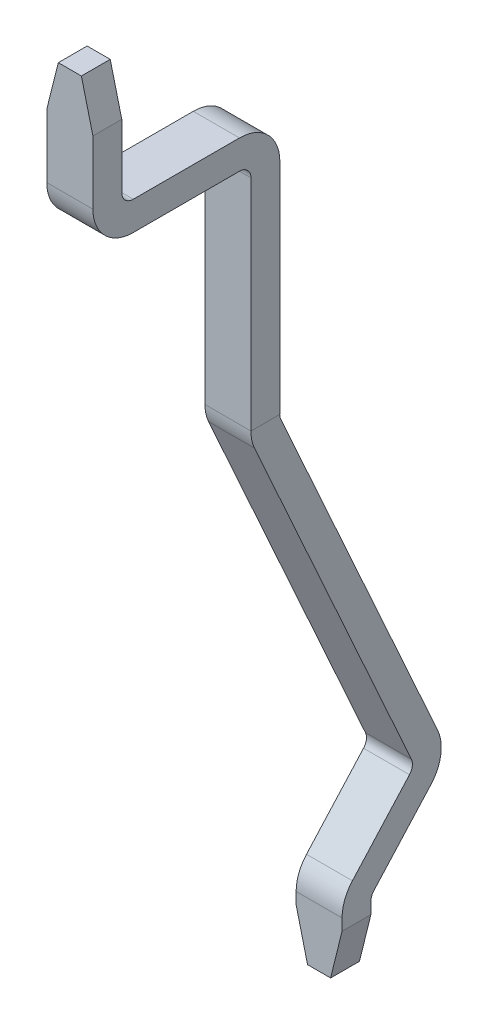
ISO-10303-21;
HEADER;
FILE_DESCRIPTION(('STEP AP214'),'2;1');
FILE_NAME('part.step','',(''),(''),'','','');
FILE_SCHEMA(('AUTOMOTIVE_DESIGN { 1 0 10303 214 1 1 1 1 }'));
ENDSEC;
DATA;
#1=APPLICATION_CONTEXT('core data for automotive mechanical design processes');
#2=APPLICATION_PROTOCOL_DEFINITION('international standard','automotive_design',2000,#1);
#3=PRODUCT_CONTEXT('',#1,'mechanical');
#4=PRODUCT('Part','Part','',(#3));
#5=PRODUCT_RELATED_PRODUCT_CATEGORY('part','',(#4));
#6=PRODUCT_DEFINITION_FORMATION('','',#4);
#7=PRODUCT_DEFINITION_CONTEXT('part definition',#1,'design');
#8=PRODUCT_DEFINITION('design','',#6,#7);
#9=PRODUCT_DEFINITION_SHAPE('','',#8);
#10=(LENGTH_UNIT() NAMED_UNIT(*) SI_UNIT(.MILLI.,.METRE.));
#11=(NAMED_UNIT(*) PLANE_ANGLE_UNIT() SI_UNIT($,.RADIAN.));
#12=(NAMED_UNIT(*) SI_UNIT($,.STERADIAN.) SOLID_ANGLE_UNIT());
#13=UNCERTAINTY_MEASURE_WITH_UNIT(LENGTH_MEASURE(1.E-05),#10,'distance_accuracy_value','');
#14=(GEOMETRIC_REPRESENTATION_CONTEXT(3) GLOBAL_UNCERTAINTY_ASSIGNED_CONTEXT((#13)) GLOBAL_UNIT_ASSIGNED_CONTEXT((#10,
#11,#12)) REPRESENTATION_CONTEXT('',''));
#15=CARTESIAN_POINT('',(0.,0.,0.));
#16=DIRECTION('',(0.,0.,1.));
#17=DIRECTION('',(1.,0.,0.));
#18=AXIS2_PLACEMENT_3D('',#15,#16,#17);
#19=CARTESIAN_POINT('',(0.,2.35,1.37));
#20=DIRECTION('',(0.,-1.,0.));
#21=DIRECTION('',(0.,0.,-1.));
#22=AXIS2_PLACEMENT_3D('',#19,#20,#21);
#23=PLANE('',#22);
#24=DIRECTION('',(0.,0.,1.));
#25=VECTOR('',#24,1.);
#26=CARTESIAN_POINT('',(-0.1,2.35,8.42052393868072));
#27=LINE('',#26,#25);
#28=CARTESIAN_POINT('',(-0.1,2.35,1.245));
#29=VERTEX_POINT('',#28);
#30=CARTESIAN_POINT('',(-0.1,2.35,1.495));
#31=VERTEX_POINT('',#30);
#32=EDGE_CURVE('E263',#29,#31,#27,.T.);
#33=ORIENTED_EDGE('',*,*,#32,.T.);
#34=DIRECTION('',(-1.,0.,0.));
#35=VECTOR('',#34,1.);
#36=CARTESIAN_POINT('',(0.2,2.35,1.495));
#37=LINE('',#36,#35);
#38=CARTESIAN_POINT('',(0.1,2.35,1.495));
#39=VERTEX_POINT('',#38);
#40=EDGE_CURVE('E234',#31,#39,#37,.F.);
#41=ORIENTED_EDGE('',*,*,#40,.T.);
#42=DIRECTION('',(0.,0.,1.));
#43=VECTOR('',#42,1.);
#44=CARTESIAN_POINT('',(0.1,2.35,8.42052883706733));
#45=LINE('',#44,#43);
#46=CARTESIAN_POINT('',(0.1,2.35,1.245));
#47=VERTEX_POINT('',#46);
#48=EDGE_CURVE('E213',#47,#39,#45,.T.);
#49=ORIENTED_EDGE('',*,*,#48,.F.);
#50=DIRECTION('',(1.,0.,0.));
#51=VECTOR('',#50,1.);
#52=CARTESIAN_POINT('',(-0.2,2.35,1.245));
#53=LINE('',#52,#51);
#54=EDGE_CURVE('E250',#47,#29,#53,.F.);
#55=ORIENTED_EDGE('',*,*,#54,.T.);
#56=EDGE_LOOP('',(#33,#41,#49,#55));
#57=FACE_BOUND('',#56,.T.);
#58=ADVANCED_FACE('F16',(#57),#23,.F.);
#59=CARTESIAN_POINT('',(-0.1,2.35,8.42052393868072));
#60=DIRECTION('',(0.970142500145331,-0.242535625036336,0.));
#61=DIRECTION('',(0.242535625036336,0.970142500145331,0.));
#62=AXIS2_PLACEMENT_3D('',#59,#60,#61);
#63=PLANE('',#62);
#64=DIRECTION('',(0.242535625036333,0.970142500145332,0.));
#65=VECTOR('',#64,1.);
#66=CARTESIAN_POINT('',(-0.2,1.95,1.495));
#67=LINE('',#66,#65);
#68=CARTESIAN_POINT('',(-0.2,1.95,1.495));
#69=VERTEX_POINT('',#68);
#70=EDGE_CURVE('E201',#69,#31,#67,.T.);
#71=ORIENTED_EDGE('',*,*,#70,.T.);
#72=ORIENTED_EDGE('',*,*,#32,.F.);
#73=DIRECTION('',(-0.242535625036333,-0.970142500145332,0.));
#74=VECTOR('',#73,1.);
#75=CARTESIAN_POINT('',(-0.1,2.35,1.245));
#76=LINE('',#75,#74);
#77=CARTESIAN_POINT('',(-0.2,1.95,1.245));
#78=VERTEX_POINT('',#77);
#79=EDGE_CURVE('E230',#29,#78,#76,.T.);
#80=ORIENTED_EDGE('',*,*,#79,.T.);
#81=DIRECTION('',(0.,0.,1.));
#82=VECTOR('',#81,1.);
#83=CARTESIAN_POINT('',(-0.2,1.95,1.495));
#84=LINE('',#83,#82);
#85=EDGE_CURVE('E241',#78,#69,#84,.T.);
#86=ORIENTED_EDGE('',*,*,#85,.T.);
#87=EDGE_LOOP('',(#71,#72,#80,#86));
#88=FACE_BOUND('',#87,.T.);
#89=ADVANCED_FACE('F400',(#88),#63,.F.);
#90=CARTESIAN_POINT('',(-0.2,2.35,1.245));
#91=DIRECTION('',(0.,0.,1.));
#92=DIRECTION('',(1.,0.,0.));
#93=AXIS2_PLACEMENT_3D('',#90,#91,#92);
#94=PLANE('',#93);
#95=ORIENTED_EDGE('',*,*,#79,.F.);
#96=ORIENTED_EDGE('',*,*,#54,.F.);
#97=DIRECTION('',(-0.242535625036336,0.970142500145331,0.));
#98=VECTOR('',#97,1.);
#99=CARTESIAN_POINT('',(0.1,2.35,1.245));
#100=LINE('',#99,#98);
#101=CARTESIAN_POINT('',(0.2,1.95,1.245));
#102=VERTEX_POINT('',#101);
#103=EDGE_CURVE('E231',#102,#47,#100,.T.);
#104=ORIENTED_EDGE('',*,*,#103,.F.);
#105=DIRECTION('',(0.,1.,0.));
#106=VECTOR('',#105,1.);
#107=CARTESIAN_POINT('',(0.2,2.35,1.245));
#108=LINE('',#107,#106);
#109=CARTESIAN_POINT('',(0.2,1.4,1.245));
#110=VERTEX_POINT('',#109);
#111=EDGE_CURVE('E220',#102,#110,#108,.F.);
#112=ORIENTED_EDGE('',*,*,#111,.T.);
#113=DIRECTION('',(-1.,0.,0.));
#114=VECTOR('',#113,1.);
#115=CARTESIAN_POINT('',(0.,1.4,1.24499999999999));
#116=LINE('',#115,#114);
#117=CARTESIAN_POINT('',(-0.2,1.4,1.245));
#118=VERTEX_POINT('',#117);
#119=EDGE_CURVE('E228',#110,#118,#116,.T.);
#120=ORIENTED_EDGE('',*,*,#119,.T.);
#121=DIRECTION('',(0.,1.,0.));
#122=VECTOR('',#121,1.);
#123=CARTESIAN_POINT('',(-0.2,2.35,1.245));
#124=LINE('',#123,#122);
#125=EDGE_CURVE('E245',#118,#78,#124,.T.);
#126=ORIENTED_EDGE('',*,*,#125,.T.);
#127=EDGE_LOOP('',(#95,#96,#104,#112,#120,#126));
#128=FACE_BOUND('',#127,.T.);
#129=ADVANCED_FACE('F395',(#128),#94,.F.);
#130=CARTESIAN_POINT('',(0.,1.4,1.145));
#131=DIRECTION('',(-1.,0.,0.));
#132=DIRECTION('',(0.,-1.,0.));
#133=AXIS2_PLACEMENT_3D('',#130,#131,#132);
#134=CYLINDRICAL_SURFACE('',#133,0.0999999999999946);
#135=ORIENTED_EDGE('',*,*,#119,.F.);
#136=CARTESIAN_POINT('',(0.2,1.4,1.145));
#137=DIRECTION('',(-1.,0.,0.));
#138=DIRECTION('',(0.,-1.,0.));
#139=AXIS2_PLACEMENT_3D('',#136,#137,#138);
#140=CIRCLE('',#139,0.0999999999999946);
#141=CARTESIAN_POINT('',(0.2,1.3,1.145));
#142=VERTEX_POINT('',#141);
#143=EDGE_CURVE('E334',#110,#142,#140,.F.);
#144=ORIENTED_EDGE('',*,*,#143,.T.);
#145=DIRECTION('',(1.,0.,0.));
#146=VECTOR('',#145,1.);
#147=CARTESIAN_POINT('',(-0.2,1.3,1.145));
#148=LINE('',#147,#146);
#149=CARTESIAN_POINT('',(-0.2,1.3,1.145));
#150=VERTEX_POINT('',#149);
#151=EDGE_CURVE('E226',#142,#150,#148,.F.);
#152=ORIENTED_EDGE('',*,*,#151,.T.);
#153=CARTESIAN_POINT('',(-0.2,1.4,1.145));
#154=DIRECTION('',(-1.,0.,0.));
#155=DIRECTION('',(0.,-1.,0.));
#156=AXIS2_PLACEMENT_3D('',#153,#154,#155);
#157=CIRCLE('',#156,0.0999999999999946);
#158=EDGE_CURVE('E339',#150,#118,#157,.T.);
#159=ORIENTED_EDGE('',*,*,#158,.T.);
#160=EDGE_LOOP('',(#135,#144,#152,#159));
#161=FACE_BOUND('',#160,.T.);
#162=ADVANCED_FACE('F392',(#161),#134,.F.);
#163=CARTESIAN_POINT('',(-0.2,1.3,1.145));
#164=DIRECTION('',(0.,-1.,0.));
#165=DIRECTION('',(0.,0.,-1.));
#166=AXIS2_PLACEMENT_3D('',#163,#164,#165);
#167=PLANE('',#166);
#168=ORIENTED_EDGE('',*,*,#151,.F.);
#169=DIRECTION('',(0.,0.,1.));
#170=VECTOR('',#169,1.);
#171=CARTESIAN_POINT('',(0.2,1.3,1.245));
#172=LINE('',#171,#170);
#173=CARTESIAN_POINT('',(0.2,1.3,0.225000000000004));
#174=VERTEX_POINT('',#173);
#175=EDGE_CURVE('E333',#142,#174,#172,.F.);
#176=ORIENTED_EDGE('',*,*,#175,.T.);
#177=DIRECTION('',(1.,0.,0.));
#178=VECTOR('',#177,1.);
#179=CARTESIAN_POINT('',(0.,1.3,0.225000000000004));
#180=LINE('',#179,#178);
#181=CARTESIAN_POINT('',(-0.2,1.3,0.225000000000004));
#182=VERTEX_POINT('',#181);
#183=EDGE_CURVE('E177',#182,#174,#180,.T.);
#184=ORIENTED_EDGE('',*,*,#183,.F.);
#185=DIRECTION('',(0.,0.,1.));
#186=VECTOR('',#185,1.);
#187=CARTESIAN_POINT('',(-0.2,1.3,1.495));
#188=LINE('',#187,#186);
#189=EDGE_CURVE('E342',#182,#150,#188,.T.);
#190=ORIENTED_EDGE('',*,*,#189,.T.);
#191=EDGE_LOOP('',(#168,#176,#184,#190));
#192=FACE_BOUND('',#191,.T.);
#193=ADVANCED_FACE('F383',(#192),#167,.F.);
#194=CARTESIAN_POINT('',(0.,0.95,0.225000000000004));
#195=DIRECTION('',(1.,0.,0.));
#196=DIRECTION('',(0.,1.,0.));
#197=AXIS2_PLACEMENT_3D('',#194,#195,#196);
#198=CYLINDRICAL_SURFACE('',#197,0.350000000000005);
#199=CARTESIAN_POINT('',(0.2,0.95,0.225000000000004));
#200=DIRECTION('',(1.,0.,0.));
#201=DIRECTION('',(0.,1.,0.));
#202=AXIS2_PLACEMENT_3D('',#199,#200,#201);
#203=CIRCLE('',#202,0.350000000000005);
#204=CARTESIAN_POINT('',(0.199999999999998,0.95,-0.125));
#205=VERTEX_POINT('',#204);
#206=EDGE_CURVE('E329',#174,#205,#203,.F.);
#207=ORIENTED_EDGE('',*,*,#206,.T.);
#208=DIRECTION('',(1.,0.,0.));
#209=VECTOR('',#208,1.);
#210=CARTESIAN_POINT('',(-0.2,0.95,-0.125));
#211=LINE('',#210,#209);
#212=CARTESIAN_POINT('',(-0.2,0.95,-0.125));
#213=VERTEX_POINT('',#212);
#214=EDGE_CURVE('E217',#205,#213,#211,.F.);
#215=ORIENTED_EDGE('',*,*,#214,.T.);
#216=CARTESIAN_POINT('',(-0.2,0.95,0.225000000000004));
#217=DIRECTION('',(1.,0.,0.));
#218=DIRECTION('',(0.,1.,0.));
#219=AXIS2_PLACEMENT_3D('',#216,#217,#218);
#220=CIRCLE('',#219,0.350000000000005);
#221=EDGE_CURVE('E187',#213,#182,#220,.T.);
#222=ORIENTED_EDGE('',*,*,#221,.T.);
#223=ORIENTED_EDGE('',*,*,#183,.T.);
#224=EDGE_LOOP('',(#207,#215,#222,#223));
#225=FACE_BOUND('',#224,.T.);
#226=ADVANCED_FACE('F388',(#225),#198,.T.);
#227=CARTESIAN_POINT('',(-0.2,0.95,-0.125));
#228=DIRECTION('',(0.,0.,1.));
#229=DIRECTION('',(1.,0.,0.));
#230=AXIS2_PLACEMENT_3D('',#227,#228,#229);
#231=PLANE('',#230);
#232=ORIENTED_EDGE('',*,*,#214,.F.);
#233=DIRECTION('',(0.,1.,0.));
#234=VECTOR('',#233,1.);
#235=CARTESIAN_POINT('',(0.199999999999995,2.35,-0.125000000000001));
#236=LINE('',#235,#234);
#237=CARTESIAN_POINT('',(0.199999999999995,-0.95,-0.125000000000002));
#238=VERTEX_POINT('',#237);
#239=EDGE_CURVE('E332',#205,#238,#236,.F.);
#240=ORIENTED_EDGE('',*,*,#239,.T.);
#241=DIRECTION('',(1.,0.,0.));
#242=VECTOR('',#241,1.);
#243=CARTESIAN_POINT('',(0.19899999999999,-0.950000000000001,-0.125000000000002));
#244=LINE('',#243,#242);
#245=CARTESIAN_POINT('',(0.198999999999995,-0.95,-0.125000000000001));
#246=VERTEX_POINT('',#245);
#247=EDGE_CURVE('E223',#246,#238,#244,.T.);
#248=ORIENTED_EDGE('',*,*,#247,.F.);
#249=DIRECTION('',(1.,0.,0.));
#250=VECTOR('',#249,1.);
#251=CARTESIAN_POINT('',(-0.2,-0.95,-0.125));
#252=LINE('',#251,#250);
#253=CARTESIAN_POINT('',(-0.198999999999995,-0.95,-0.125000000000001));
#254=VERTEX_POINT('',#253);
#255=EDGE_CURVE('E173',#254,#246,#252,.T.);
#256=ORIENTED_EDGE('',*,*,#255,.F.);
#257=DIRECTION('',(1.,0.,0.));
#258=VECTOR('',#257,1.);
#259=CARTESIAN_POINT('',(-0.198999999999996,-0.95,-0.125));
#260=LINE('',#259,#258);
#261=CARTESIAN_POINT('',(-0.2,-0.95,-0.125));
#262=VERTEX_POINT('',#261);
#263=EDGE_CURVE('E19',#262,#254,#260,.T.);
#264=ORIENTED_EDGE('',*,*,#263,.F.);
#265=DIRECTION('',(0.,1.,0.));
#266=VECTOR('',#265,1.);
#267=CARTESIAN_POINT('',(-0.2,2.35,-0.125));
#268=LINE('',#267,#266);
#269=EDGE_CURVE('E171',#262,#213,#268,.T.);
#270=ORIENTED_EDGE('',*,*,#269,.T.);
#271=EDGE_LOOP('',(#232,#240,#248,#256,#264,#270));
#272=FACE_BOUND('',#271,.T.);
#273=ADVANCED_FACE('F170',(#272),#231,.F.);
#274=CARTESIAN_POINT('',(0.2,1.05,1.145));
#275=DIRECTION('',(0.,1.,0.));
#276=DIRECTION('',(0.,0.,1.));
#277=AXIS2_PLACEMENT_3D('',#274,#275,#276);
#278=PLANE('',#277);
#279=DIRECTION('',(-1.,0.,0.));
#280=VECTOR('',#279,1.);
#281=CARTESIAN_POINT('',(0.,1.05,1.145));
#282=LINE('',#281,#280);
#283=CARTESIAN_POINT('',(-0.2,1.05,1.145));
#284=VERTEX_POINT('',#283);
#285=CARTESIAN_POINT('',(0.2,1.05,1.145));
#286=VERTEX_POINT('',#285);
#287=EDGE_CURVE('E202',#284,#286,#282,.F.);
#288=ORIENTED_EDGE('',*,*,#287,.F.);
#289=DIRECTION('',(0.,0.,1.));
#290=VECTOR('',#289,1.);
#291=CARTESIAN_POINT('',(-0.2,1.05,1.495));
#292=LINE('',#291,#290);
#293=CARTESIAN_POINT('',(-0.2,1.05,0.225000000000004));
#294=VERTEX_POINT('',#293);
#295=EDGE_CURVE('E193',#284,#294,#292,.F.);
#296=ORIENTED_EDGE('',*,*,#295,.T.);
#297=DIRECTION('',(1.,0.,0.));
#298=VECTOR('',#297,1.);
#299=CARTESIAN_POINT('',(0.,1.05,0.225000000000004));
#300=LINE('',#299,#298);
#301=CARTESIAN_POINT('',(0.2,1.05,0.225000000000004));
#302=VERTEX_POINT('',#301);
#303=EDGE_CURVE('E218',#294,#302,#300,.T.);
#304=ORIENTED_EDGE('',*,*,#303,.T.);
#305=DIRECTION('',(0.,0.,1.));
#306=VECTOR('',#305,1.);
#307=CARTESIAN_POINT('',(0.2,1.05,1.245));
#308=LINE('',#307,#306);
#309=EDGE_CURVE('E324',#302,#286,#308,.T.);
#310=ORIENTED_EDGE('',*,*,#309,.T.);
#311=EDGE_LOOP('',(#288,#296,#304,#310));
#312=FACE_BOUND('',#311,.T.);
#313=ADVANCED_FACE('F534',(#312),#278,.F.);
#314=CARTESIAN_POINT('',(0.,1.4,1.145));
#315=DIRECTION('',(-1.,0.,0.));
#316=DIRECTION('',(0.,-1.,0.));
#317=AXIS2_PLACEMENT_3D('',#314,#315,#316);
#318=CYLINDRICAL_SURFACE('',#317,0.349999999999995);
#319=CARTESIAN_POINT('',(-0.2,1.4,1.145));
#320=DIRECTION('',(-1.,0.,0.));
#321=DIRECTION('',(0.,-1.,0.));
#322=AXIS2_PLACEMENT_3D('',#319,#320,#321);
#323=CIRCLE('',#322,0.349999999999995);
#324=CARTESIAN_POINT('',(-0.2,1.4,1.495));
#325=VERTEX_POINT('',#324);
#326=EDGE_CURVE('E195',#325,#284,#323,.F.);
#327=ORIENTED_EDGE('',*,*,#326,.T.);
#328=ORIENTED_EDGE('',*,*,#287,.T.);
#329=CARTESIAN_POINT('',(0.2,1.4,1.145));
#330=DIRECTION('',(-1.,0.,0.));
#331=DIRECTION('',(0.,-1.,0.));
#332=AXIS2_PLACEMENT_3D('',#329,#330,#331);
#333=CIRCLE('',#332,0.349999999999995);
#334=CARTESIAN_POINT('',(0.2,1.4,1.495));
#335=VERTEX_POINT('',#334);
#336=EDGE_CURVE('E321',#286,#335,#333,.T.);
#337=ORIENTED_EDGE('',*,*,#336,.T.);
#338=DIRECTION('',(-1.,0.,0.));
#339=VECTOR('',#338,1.);
#340=CARTESIAN_POINT('',(0.2,1.4,1.495));
#341=LINE('',#340,#339);
#342=EDGE_CURVE('E198',#335,#325,#341,.T.);
#343=ORIENTED_EDGE('',*,*,#342,.T.);
#344=EDGE_LOOP('',(#327,#328,#337,#343));
#345=FACE_BOUND('',#344,.T.);
#346=ADVANCED_FACE('F531',(#345),#318,.T.);
#347=CARTESIAN_POINT('',(0.2,2.35,1.495));
#348=DIRECTION('',(0.,0.,-1.));
#349=DIRECTION('',(-1.,0.,0.));
#350=AXIS2_PLACEMENT_3D('',#347,#348,#349);
#351=PLANE('',#350);
#352=ORIENTED_EDGE('',*,*,#70,.F.);
#353=DIRECTION('',(0.,1.,0.));
#354=VECTOR('',#353,1.);
#355=CARTESIAN_POINT('',(-0.2,2.35,1.495));
#356=LINE('',#355,#354);
#357=EDGE_CURVE('E244',#69,#325,#356,.F.);
#358=ORIENTED_EDGE('',*,*,#357,.T.);
#359=ORIENTED_EDGE('',*,*,#342,.F.);
#360=DIRECTION('',(0.,1.,0.));
#361=VECTOR('',#360,1.);
#362=CARTESIAN_POINT('',(0.200000000000001,2.35,1.495));
#363=LINE('',#362,#361);
#364=CARTESIAN_POINT('',(0.200000000000001,1.95,1.495));
#365=VERTEX_POINT('',#364);
#366=EDGE_CURVE('E207',#335,#365,#363,.T.);
#367=ORIENTED_EDGE('',*,*,#366,.T.);
#368=DIRECTION('',(-0.242535625036336,0.970142500145331,0.));
#369=VECTOR('',#368,1.);
#370=CARTESIAN_POINT('',(0.1,2.35,1.495));
#371=LINE('',#370,#369);
#372=EDGE_CURVE('E210',#39,#365,#371,.F.);
#373=ORIENTED_EDGE('',*,*,#372,.F.);
#374=ORIENTED_EDGE('',*,*,#40,.F.);
#375=EDGE_LOOP('',(#352,#358,#359,#367,#373,#374));
#376=FACE_BOUND('',#375,.T.);
#377=ADVANCED_FACE('F527',(#376),#351,.F.);
#378=CARTESIAN_POINT('',(0.1,2.35,8.42052883706733));
#379=DIRECTION('',(0.970142500145331,0.242535625036336,0.));
#380=DIRECTION('',(-0.242535625036336,0.970142500145331,0.));
#381=AXIS2_PLACEMENT_3D('',#378,#379,#380);
#382=PLANE('',#381);
#383=ORIENTED_EDGE('',*,*,#372,.T.);
#384=DIRECTION('',(0.,0.,1.));
#385=VECTOR('',#384,1.);
#386=CARTESIAN_POINT('',(0.2,1.95,1.245));
#387=LINE('',#386,#385);
#388=EDGE_CURVE('E203',#365,#102,#387,.F.);
#389=ORIENTED_EDGE('',*,*,#388,.T.);
#390=ORIENTED_EDGE('',*,*,#103,.T.);
#391=ORIENTED_EDGE('',*,*,#48,.T.);
#392=EDGE_LOOP('',(#383,#389,#390,#391));
#393=FACE_BOUND('',#392,.T.);
#394=ADVANCED_FACE('F524',(#393),#382,.T.);
#395=CARTESIAN_POINT('',(-0.2,2.35,1.495));
#396=DIRECTION('',(1.,0.,0.));
#397=DIRECTION('',(0.,1.,0.));
#398=AXIS2_PLACEMENT_3D('',#395,#396,#397);
#399=PLANE('',#398);
#400=ORIENTED_EDGE('',*,*,#85,.F.);
#401=ORIENTED_EDGE('',*,*,#125,.F.);
#402=ORIENTED_EDGE('',*,*,#158,.F.);
#403=ORIENTED_EDGE('',*,*,#189,.F.);
#404=ORIENTED_EDGE('',*,*,#221,.F.);
#405=ORIENTED_EDGE('',*,*,#269,.F.);
#406=DIRECTION('',(0.,0.,1.));
#407=VECTOR('',#406,1.);
#408=CARTESIAN_POINT('',(-0.2,-0.95,1.495));
#409=LINE('',#408,#407);
#410=CARTESIAN_POINT('',(-0.199999999999998,-0.95,0.125));
#411=VERTEX_POINT('',#410);
#412=EDGE_CURVE('E183',#411,#262,#409,.F.);
#413=ORIENTED_EDGE('',*,*,#412,.F.);
#414=DIRECTION('',(0.,1.,0.));
#415=VECTOR('',#414,1.);
#416=CARTESIAN_POINT('',(-0.199999999999996,0.95,0.125));
#417=LINE('',#416,#415);
#418=CARTESIAN_POINT('',(-0.199999999999998,0.95,0.125));
#419=VERTEX_POINT('',#418);
#420=EDGE_CURVE('E206',#411,#419,#417,.T.);
#421=ORIENTED_EDGE('',*,*,#420,.T.);
#422=CARTESIAN_POINT('',(-0.2,0.95,0.225000000000004));
#423=DIRECTION('',(1.,0.,0.));
#424=DIRECTION('',(0.,1.,0.));
#425=AXIS2_PLACEMENT_3D('',#422,#423,#424);
#426=CIRCLE('',#425,0.100000000000005);
#427=EDGE_CURVE('E221',#419,#294,#426,.T.);
#428=ORIENTED_EDGE('',*,*,#427,.T.);
#429=ORIENTED_EDGE('',*,*,#295,.F.);
#430=ORIENTED_EDGE('',*,*,#326,.F.);
#431=ORIENTED_EDGE('',*,*,#357,.F.);
#432=EDGE_LOOP('',(#400,#401,#402,#403,#404,#405,#413,#421,#428,#429,#430,#431));
#433=FACE_BOUND('',#432,.T.);
#434=ADVANCED_FACE('F181',(#433),#399,.F.);
#435=CARTESIAN_POINT('',(0.,0.95,0.225000000000004));
#436=DIRECTION('',(1.,0.,0.));
#437=DIRECTION('',(0.,1.,0.));
#438=AXIS2_PLACEMENT_3D('',#435,#436,#437);
#439=CYLINDRICAL_SURFACE('',#438,0.100000000000005);
#440=ORIENTED_EDGE('',*,*,#303,.F.);
#441=ORIENTED_EDGE('',*,*,#427,.F.);
#442=DIRECTION('',(-1.,0.,0.));
#443=VECTOR('',#442,1.);
#444=CARTESIAN_POINT('',(0.2,0.95,0.125));
#445=LINE('',#444,#443);
#446=CARTESIAN_POINT('',(0.2,0.95,0.125));
#447=VERTEX_POINT('',#446);
#448=EDGE_CURVE('E370',#419,#447,#445,.F.);
#449=ORIENTED_EDGE('',*,*,#448,.T.);
#450=CARTESIAN_POINT('',(0.2,0.95,0.225000000000004));
#451=DIRECTION('',(1.,0.,0.));
#452=DIRECTION('',(0.,1.,0.));
#453=AXIS2_PLACEMENT_3D('',#450,#451,#452);
#454=CIRCLE('',#453,0.100000000000005);
#455=EDGE_CURVE('E325',#447,#302,#454,.T.);
#456=ORIENTED_EDGE('',*,*,#455,.T.);
#457=EDGE_LOOP('',(#440,#441,#449,#456));
#458=FACE_BOUND('',#457,.T.);
#459=ADVANCED_FACE('F518',(#458),#439,.F.);
#460=CARTESIAN_POINT('',(0.2,2.35,1.245));
#461=DIRECTION('',(-1.,0.,0.));
#462=DIRECTION('',(0.,0.,1.));
#463=AXIS2_PLACEMENT_3D('',#460,#461,#462);
#464=PLANE('',#463);
#465=ORIENTED_EDGE('',*,*,#366,.F.);
#466=ORIENTED_EDGE('',*,*,#336,.F.);
#467=ORIENTED_EDGE('',*,*,#309,.F.);
#468=ORIENTED_EDGE('',*,*,#455,.F.);
#469=DIRECTION('',(0.,1.,0.));
#470=VECTOR('',#469,1.);
#471=CARTESIAN_POINT('',(0.2,0.95,0.125));
#472=LINE('',#471,#470);
#473=CARTESIAN_POINT('',(0.199999999999998,-0.95,0.125));
#474=VERTEX_POINT('',#473);
#475=EDGE_CURVE('E358',#447,#474,#472,.F.);
#476=ORIENTED_EDGE('',*,*,#475,.T.);
#477=DIRECTION('',(0.,0.,1.));
#478=VECTOR('',#477,1.);
#479=CARTESIAN_POINT('',(0.2,-0.95,1.245));
#480=LINE('',#479,#478);
#481=EDGE_CURVE('E328',#238,#474,#480,.T.);
#482=ORIENTED_EDGE('',*,*,#481,.F.);
#483=ORIENTED_EDGE('',*,*,#239,.F.);
#484=ORIENTED_EDGE('',*,*,#206,.F.);
#485=ORIENTED_EDGE('',*,*,#175,.F.);
#486=ORIENTED_EDGE('',*,*,#143,.F.);
#487=ORIENTED_EDGE('',*,*,#111,.F.);
#488=ORIENTED_EDGE('',*,*,#388,.F.);
#489=EDGE_LOOP('',(#465,#466,#467,#468,#476,#482,#483,#484,#485,#486,#487,#488));
#490=FACE_BOUND('',#489,.T.);
#491=ADVANCED_FACE('F355',(#490),#464,.F.);
#492=CARTESIAN_POINT('',(0.2,0.95,0.125));
#493=DIRECTION('',(0.,0.,-1.));
#494=DIRECTION('',(-1.,0.,0.));
#495=AXIS2_PLACEMENT_3D('',#492,#493,#494);
#496=PLANE('',#495);
#497=ORIENTED_EDGE('',*,*,#448,.F.);
#498=ORIENTED_EDGE('',*,*,#420,.F.);
#499=DIRECTION('',(-1.,0.,0.));
#500=VECTOR('',#499,1.);
#501=CARTESIAN_POINT('',(0.2,-0.95,0.125));
#502=LINE('',#501,#500);
#503=CARTESIAN_POINT('',(-0.198999999999993,-0.95,0.124999999999999));
#504=VERTEX_POINT('',#503);
#505=EDGE_CURVE('E192',#411,#504,#502,.F.);
#506=ORIENTED_EDGE('',*,*,#505,.T.);
#507=DIRECTION('',(-1.,0.,0.));
#508=VECTOR('',#507,1.);
#509=CARTESIAN_POINT('',(0.,-0.95,0.124999999999998));
#510=LINE('',#509,#508);
#511=CARTESIAN_POINT('',(0.198999999999997,-0.95,0.124999999999999));
#512=VERTEX_POINT('',#511);
#513=EDGE_CURVE('E315',#512,#504,#510,.T.);
#514=ORIENTED_EDGE('',*,*,#513,.F.);
#515=DIRECTION('',(-1.,0.,0.));
#516=VECTOR('',#515,1.);
#517=CARTESIAN_POINT('',(0.2,-0.95,0.125));
#518=LINE('',#517,#516);
#519=EDGE_CURVE('E316',#512,#474,#518,.F.);
#520=ORIENTED_EDGE('',*,*,#519,.T.);
#521=ORIENTED_EDGE('',*,*,#475,.F.);
#522=EDGE_LOOP('',(#497,#498,#506,#514,#520,#521));
#523=FACE_BOUND('',#522,.T.);
#524=ADVANCED_FACE('F511',(#523),#496,.F.);
#525=CARTESIAN_POINT('',(0.,-5.5,-0.79));
#526=DIRECTION('',(0.,-1.,0.));
#527=DIRECTION('',(0.,0.,-1.));
#528=AXIS2_PLACEMENT_3D('',#525,#526,#527);
#529=PLANE('',#528);
#530=DIRECTION('',(1.,0.,0.));
#531=VECTOR('',#530,1.);
#532=CARTESIAN_POINT('',(0.2,-5.5,-0.665));
#533=LINE('',#532,#531);
#534=CARTESIAN_POINT('',(0.1,-5.5,-0.665));
#535=VERTEX_POINT('',#534);
#536=CARTESIAN_POINT('',(-0.1,-5.5,-0.665));
#537=VERTEX_POINT('',#536);
#538=EDGE_CURVE('E637',#535,#537,#533,.F.);
#539=ORIENTED_EDGE('',*,*,#538,.T.);
#540=DIRECTION('',(0.,0.,1.));
#541=VECTOR('',#540,1.);
#542=CARTESIAN_POINT('',(-0.1,-5.5,-8.42052393868072));
#543=LINE('',#542,#541);
#544=CARTESIAN_POINT('',(-0.1,-5.5,-0.915));
#545=VERTEX_POINT('',#544);
#546=EDGE_CURVE('E319',#537,#545,#543,.F.);
#547=ORIENTED_EDGE('',*,*,#546,.T.);
#548=DIRECTION('',(1.,0.,0.));
#549=VECTOR('',#548,1.);
#550=CARTESIAN_POINT('',(-0.2,-5.5,-0.915));
#551=LINE('',#550,#549);
#552=CARTESIAN_POINT('',(0.1,-5.5,-0.915));
#553=VERTEX_POINT('',#552);
#554=EDGE_CURVE('E594',#545,#553,#551,.T.);
#555=ORIENTED_EDGE('',*,*,#554,.T.);
#556=DIRECTION('',(0.,0.,1.));
#557=VECTOR('',#556,1.);
#558=CARTESIAN_POINT('',(0.1,-5.5,-8.42052393868072));
#559=LINE('',#558,#557);
#560=EDGE_CURVE('E320',#535,#553,#559,.F.);
#561=ORIENTED_EDGE('',*,*,#560,.F.);
#562=EDGE_LOOP('',(#539,#547,#555,#561));
#563=FACE_BOUND('',#562,.T.);
#564=ADVANCED_FACE('F507',(#563),#529,.T.);
#565=CARTESIAN_POINT('',(0.1,-5.5,-8.42052393868072));
#566=DIRECTION('',(0.970710817842158,-0.240250927415917,0.));
#567=DIRECTION('',(0.240250927415917,0.970710817842158,0.));
#568=AXIS2_PLACEMENT_3D('',#565,#566,#567);
#569=PLANE('',#568);
#570=DIRECTION('',(-0.240250927415917,-0.970710817842158,0.));
#571=VECTOR('',#570,1.);
#572=CARTESIAN_POINT('',(0.198999999999993,-5.1,-0.665));
#573=LINE('',#572,#571);
#574=CARTESIAN_POINT('',(0.198999999999993,-5.1,-0.665));
#575=VERTEX_POINT('',#574);
#576=EDGE_CURVE('E633',#575,#535,#573,.T.);
#577=ORIENTED_EDGE('',*,*,#576,.T.);
#578=ORIENTED_EDGE('',*,*,#560,.T.);
#579=DIRECTION('',(0.240250927415917,0.970710817842158,0.));
#580=VECTOR('',#579,1.);
#581=CARTESIAN_POINT('',(0.1,-5.5,-0.915));
#582=LINE('',#581,#580);
#583=CARTESIAN_POINT('',(0.198999999999993,-5.1,-0.915));
#584=VERTEX_POINT('',#583);
#585=EDGE_CURVE('E590',#553,#584,#582,.T.);
#586=ORIENTED_EDGE('',*,*,#585,.T.);
#587=DIRECTION('',(0.,0.,-1.));
#588=VECTOR('',#587,1.);
#589=CARTESIAN_POINT('',(0.198999999999996,-5.1,0.125));
#590=LINE('',#589,#588);
#591=EDGE_CURVE('E580',#575,#584,#590,.T.);
#592=ORIENTED_EDGE('',*,*,#591,.F.);
#593=EDGE_LOOP('',(#577,#578,#586,#592));
#594=FACE_BOUND('',#593,.T.);
#595=ADVANCED_FACE('F504',(#594),#569,.T.);
#596=CARTESIAN_POINT('',(0.19899999999999,-0.95,-1.525));
#597=DIRECTION('',(0.,1.,0.));
#598=DIRECTION('',(0.,0.,1.));
#599=AXIS2_PLACEMENT_3D('',#596,#597,#598);
#600=PLANE('',#599);
#601=ORIENTED_EDGE('',*,*,#519,.F.);
#602=DIRECTION('',(0.,0.,-1.));
#603=VECTOR('',#602,1.);
#604=CARTESIAN_POINT('',(0.198999999999996,-0.95,0.125));
#605=LINE('',#604,#603);
#606=EDGE_CURVE('E305',#246,#512,#605,.F.);
#607=ORIENTED_EDGE('',*,*,#606,.F.);
#608=ORIENTED_EDGE('',*,*,#247,.T.);
#609=ORIENTED_EDGE('',*,*,#481,.T.);
#610=EDGE_LOOP('',(#601,#607,#608,#609));
#611=FACE_BOUND('',#610,.T.);
#612=ADVANCED_FACE('F348',(#611),#600,.F.);
#613=CARTESIAN_POINT('',(-0.1,-5.5,-8.42052393868072));
#614=DIRECTION('',(0.970710817842158,0.240250927415917,0.));
#615=DIRECTION('',(-0.240250927415917,0.970710817842158,0.));
#616=AXIS2_PLACEMENT_3D('',#613,#614,#615);
#617=PLANE('',#616);
#618=DIRECTION('',(-0.240250927415917,0.970710817842158,0.));
#619=VECTOR('',#618,1.);
#620=CARTESIAN_POINT('',(-0.1,-5.5,-0.665));
#621=LINE('',#620,#619);
#622=CARTESIAN_POINT('',(-0.198999999999993,-5.1,-0.665));
#623=VERTEX_POINT('',#622);
#624=EDGE_CURVE('E634',#537,#623,#621,.T.);
#625=ORIENTED_EDGE('',*,*,#624,.T.);
#626=DIRECTION('',(0.,0.,1.));
#627=VECTOR('',#626,1.);
#628=CARTESIAN_POINT('',(-0.198999999999996,-5.1,0.125));
#629=LINE('',#628,#627);
#630=CARTESIAN_POINT('',(-0.198999999999993,-5.1,-0.915));
#631=VERTEX_POINT('',#630);
#632=EDGE_CURVE('E293',#631,#623,#629,.T.);
#633=ORIENTED_EDGE('',*,*,#632,.F.);
#634=DIRECTION('',(0.240250927415917,-0.970710817842158,0.));
#635=VECTOR('',#634,1.);
#636=CARTESIAN_POINT('',(-0.198999999999993,-5.1,-0.915));
#637=LINE('',#636,#635);
#638=EDGE_CURVE('E608',#631,#545,#637,.T.);
#639=ORIENTED_EDGE('',*,*,#638,.T.);
#640=ORIENTED_EDGE('',*,*,#546,.F.);
#641=EDGE_LOOP('',(#625,#633,#639,#640));
#642=FACE_BOUND('',#641,.T.);
#643=ADVANCED_FACE('F497',(#642),#617,.F.);
#644=CARTESIAN_POINT('',(0.2,-5.,-0.665));
#645=DIRECTION('',(0.,0.,-1.));
#646=DIRECTION('',(0.,1.,0.));
#647=AXIS2_PLACEMENT_3D('',#644,#645,#646);
#648=PLANE('',#647);
#649=DIRECTION('',(0.,1.,0.));
#650=VECTOR('',#649,1.);
#651=CARTESIAN_POINT('',(0.198999999999993,-5.5,-0.665));
#652=LINE('',#651,#650);
#653=CARTESIAN_POINT('',(0.198999999999993,-5.,-0.665000000000002));
#654=VERTEX_POINT('',#653);
#655=EDGE_CURVE('E586',#654,#575,#652,.F.);
#656=ORIENTED_EDGE('',*,*,#655,.F.);
#657=DIRECTION('',(-1.,0.,0.));
#658=VECTOR('',#657,1.);
#659=CARTESIAN_POINT('',(0.,-5.,-0.665000000000005));
#660=LINE('',#659,#658);
#661=CARTESIAN_POINT('',(-0.198999999999993,-5.,-0.665000000000002));
#662=VERTEX_POINT('',#661);
#663=EDGE_CURVE('E631',#662,#654,#660,.F.);
#664=ORIENTED_EDGE('',*,*,#663,.F.);
#665=DIRECTION('',(0.,1.,0.));
#666=VECTOR('',#665,1.);
#667=CARTESIAN_POINT('',(-0.198999999999993,-5.5,-0.665));
#668=LINE('',#667,#666);
#669=EDGE_CURVE('E289',#623,#662,#668,.T.);
#670=ORIENTED_EDGE('',*,*,#669,.F.);
#671=ORIENTED_EDGE('',*,*,#624,.F.);
#672=ORIENTED_EDGE('',*,*,#538,.F.);
#673=ORIENTED_EDGE('',*,*,#576,.F.);
#674=EDGE_LOOP('',(#656,#664,#670,#671,#672,#673));
#675=FACE_BOUND('',#674,.T.);
#676=ADVANCED_FACE('F493',(#675),#648,.F.);
#677=CARTESIAN_POINT('',(0.,-5.,-1.015));
#678=DIRECTION('',(-1.,0.,0.));
#679=DIRECTION('',(0.,-1.,0.));
#680=AXIS2_PLACEMENT_3D('',#677,#678,#679);
#681=CYLINDRICAL_SURFACE('',#680,0.349999999999995);
#682=CARTESIAN_POINT('',(0.198999999999993,-5.,-1.015));
#683=DIRECTION('',(-1.,0.,0.));
#684=DIRECTION('',(0.,-1.,0.));
#685=AXIS2_PLACEMENT_3D('',#682,#683,#684);
#686=CIRCLE('',#685,0.349999999999995);
#687=CARTESIAN_POINT('',(0.198999999999993,-4.76575423726739,-0.754944385482999));
#688=VERTEX_POINT('',#687);
#689=EDGE_CURVE('E294',#688,#654,#686,.F.);
#690=ORIENTED_EDGE('',*,*,#689,.F.);
#691=DIRECTION('',(1.,0.,0.));
#692=VECTOR('',#691,1.);
#693=CARTESIAN_POINT('',(0.2,-4.76575423726739,-0.754944385483));
#694=LINE('',#693,#692);
#695=CARTESIAN_POINT('',(-0.198999999999993,-4.76575423726739,-0.754944385482999));
#696=VERTEX_POINT('',#695);
#697=EDGE_CURVE('E628',#688,#696,#694,.F.);
#698=ORIENTED_EDGE('',*,*,#697,.T.);
#699=CARTESIAN_POINT('',(-0.198999999999993,-5.,-1.015));
#700=DIRECTION('',(-1.,0.,0.));
#701=DIRECTION('',(0.,-1.,0.));
#702=AXIS2_PLACEMENT_3D('',#699,#700,#701);
#703=CIRCLE('',#702,0.349999999999995);
#704=EDGE_CURVE('E287',#662,#696,#703,.T.);
#705=ORIENTED_EDGE('',*,*,#704,.F.);
#706=ORIENTED_EDGE('',*,*,#663,.T.);
#707=EDGE_LOOP('',(#690,#698,#705,#706));
#708=FACE_BOUND('',#707,.T.);
#709=ADVANCED_FACE('F489',(#708),#681,.T.);
#710=CARTESIAN_POINT('',(0.2,-4.21692736078075,-1.24930160414772));
#711=DIRECTION('',(0.,-0.669273607807463,-0.743016041477155));
#712=DIRECTION('',(0.,0.743016041477155,-0.669273607807463));
#713=AXIS2_PLACEMENT_3D('',#710,#711,#712);
#714=PLANE('',#713);
#715=ORIENTED_EDGE('',*,*,#697,.F.);
#716=DIRECTION('',(0.,-0.743016041477151,0.669273607807469));
#717=VECTOR('',#716,1.);
#718=CARTESIAN_POINT('',(0.198999999999991,-4.21692736078075,-1.24930160414772));
#719=LINE('',#718,#717);
#720=CARTESIAN_POINT('',(0.198999999999991,-4.21692736078075,-1.24930160414772));
#721=VERTEX_POINT('',#720);
#722=EDGE_CURVE('E297',#721,#688,#719,.T.);
#723=ORIENTED_EDGE('',*,*,#722,.F.);
#724=DIRECTION('',(1.,0.,0.));
#725=VECTOR('',#724,1.);
#726=CARTESIAN_POINT('',(0.,-4.21692736078075,-1.24930160414772));
#727=LINE('',#726,#725);
#728=CARTESIAN_POINT('',(-0.198999999999991,-4.21692736078075,-1.24930160414772));
#729=VERTEX_POINT('',#728);
#730=EDGE_CURVE('E625',#721,#729,#727,.F.);
#731=ORIENTED_EDGE('',*,*,#730,.T.);
#732=DIRECTION('',(0.,0.743016041477151,-0.669273607807469));
#733=VECTOR('',#732,1.);
#734=CARTESIAN_POINT('',(-0.198999999999993,-4.76575423726739,-0.754944385482996));
#735=LINE('',#734,#733);
#736=EDGE_CURVE('E286',#696,#729,#735,.T.);
#737=ORIENTED_EDGE('',*,*,#736,.F.);
#738=EDGE_LOOP('',(#715,#723,#731,#737));
#739=FACE_BOUND('',#738,.T.);
#740=ADVANCED_FACE('F485',(#739),#714,.F.);
#741=CARTESIAN_POINT('',(0.,-4.15,-1.175));
#742=DIRECTION('',(1.,0.,0.));
#743=DIRECTION('',(0.,1.,0.));
#744=AXIS2_PLACEMENT_3D('',#741,#742,#743);
#745=CYLINDRICAL_SURFACE('',#744,0.100000000000005);
#746=ORIENTED_EDGE('',*,*,#730,.F.);
#747=CARTESIAN_POINT('',(0.19899999999999,-4.15,-1.175));
#748=DIRECTION('',(1.,0.,0.));
#749=DIRECTION('',(0.,1.,0.));
#750=AXIS2_PLACEMENT_3D('',#747,#748,#749);
#751=CIRCLE('',#750,0.100000000000005);
#752=CARTESIAN_POINT('',(0.19899999999999,-4.10887647540836,-1.26615292494024));
#753=VERTEX_POINT('',#752);
#754=EDGE_CURVE('E298',#753,#721,#751,.F.);
#755=ORIENTED_EDGE('',*,*,#754,.F.);
#756=DIRECTION('',(1.,0.,0.));
#757=VECTOR('',#756,1.);
#758=CARTESIAN_POINT('',(0.2,-4.10887647540836,-1.26615292494024));
#759=LINE('',#758,#757);
#760=CARTESIAN_POINT('',(-0.198999999999991,-4.10887647540836,-1.26615292494024));
#761=VERTEX_POINT('',#760);
#762=EDGE_CURVE('E622',#753,#761,#759,.F.);
#763=ORIENTED_EDGE('',*,*,#762,.T.);
#764=CARTESIAN_POINT('',(-0.198999999999991,-4.15,-1.175));
#765=DIRECTION('',(1.,0.,0.));
#766=DIRECTION('',(0.,1.,0.));
#767=AXIS2_PLACEMENT_3D('',#764,#765,#766);
#768=CIRCLE('',#767,0.100000000000005);
#769=EDGE_CURVE('E284',#729,#761,#768,.T.);
#770=ORIENTED_EDGE('',*,*,#769,.F.);
#771=EDGE_LOOP('',(#746,#755,#763,#770));
#772=FACE_BOUND('',#771,.T.);
#773=ADVANCED_FACE('F481',(#772),#745,.F.);
#774=CARTESIAN_POINT('',(0.2,-1.09393233607072,0.0940352372908434));
#775=DIRECTION('',(0.,0.411235245916341,-0.911529249402413));
#776=DIRECTION('',(0.,0.911529249402413,0.411235245916341));
#777=AXIS2_PLACEMENT_3D('',#774,#775,#776);
#778=PLANE('',#777);
#779=ORIENTED_EDGE('',*,*,#762,.F.);
#780=DIRECTION('',(0.,-0.911529249402413,-0.411235245916341));
#781=VECTOR('',#780,1.);
#782=CARTESIAN_POINT('',(0.198999999999996,-1.09393233607072,0.0940352372908435));
#783=LINE('',#782,#781);
#784=CARTESIAN_POINT('',(0.198999999999996,-1.09393233607072,0.0940352372908433));
#785=VERTEX_POINT('',#784);
#786=EDGE_CURVE('E301',#785,#753,#783,.T.);
#787=ORIENTED_EDGE('',*,*,#786,.F.);
#788=DIRECTION('',(-1.,0.,0.));
#789=VECTOR('',#788,1.);
#790=CARTESIAN_POINT('',(0.,-1.09393233607072,0.0940352372908421));
#791=LINE('',#790,#789);
#792=CARTESIAN_POINT('',(-0.198999999999993,-1.09393233607072,0.0940352372908435));
#793=VERTEX_POINT('',#792);
#794=EDGE_CURVE('E620',#793,#785,#791,.F.);
#795=ORIENTED_EDGE('',*,*,#794,.F.);
#796=DIRECTION('',(0.,0.911529249402413,0.411235245916341));
#797=VECTOR('',#796,1.);
#798=CARTESIAN_POINT('',(-0.198999999999991,-4.10887647540836,-1.26615292494024));
#799=LINE('',#798,#797);
#800=EDGE_CURVE('E283',#761,#793,#799,.T.);
#801=ORIENTED_EDGE('',*,*,#800,.F.);
#802=EDGE_LOOP('',(#779,#787,#795,#801));
#803=FACE_BOUND('',#802,.T.);
#804=ADVANCED_FACE('F477',(#803),#778,.F.);
#805=CARTESIAN_POINT('',(0.,-0.95,-0.224999999999997));
#806=DIRECTION('',(-1.,0.,0.));
#807=DIRECTION('',(0.,-1.,0.));
#808=AXIS2_PLACEMENT_3D('',#805,#806,#807);
#809=CYLINDRICAL_SURFACE('',#808,0.349999999999995);
#810=CARTESIAN_POINT('',(0.198999999999996,-0.95,-0.224999999999997));
#811=DIRECTION('',(-1.,0.,0.));
#812=DIRECTION('',(0.,-1.,0.));
#813=AXIS2_PLACEMENT_3D('',#810,#811,#812);
#814=CIRCLE('',#813,0.349999999999995);
#815=EDGE_CURVE('E302',#512,#785,#814,.F.);
#816=ORIENTED_EDGE('',*,*,#815,.F.);
#817=ORIENTED_EDGE('',*,*,#513,.T.);
#818=CARTESIAN_POINT('',(-0.19899999999999,-0.95,-0.224999999999997));
#819=DIRECTION('',(-1.,0.,0.));
#820=DIRECTION('',(0.,-1.,0.));
#821=AXIS2_PLACEMENT_3D('',#818,#819,#820);
#822=CIRCLE('',#821,0.349999999999995);
#823=EDGE_CURVE('E280',#793,#504,#822,.T.);
#824=ORIENTED_EDGE('',*,*,#823,.F.);
#825=ORIENTED_EDGE('',*,*,#794,.T.);
#826=EDGE_LOOP('',(#816,#817,#824,#825));
#827=FACE_BOUND('',#826,.T.);
#828=ADVANCED_FACE('F474',(#827),#809,.T.);
#829=CARTESIAN_POINT('',(-0.198999999999996,-0.95,0.125));
#830=DIRECTION('',(0.,1.,0.));
#831=DIRECTION('',(0.,0.,1.));
#832=AXIS2_PLACEMENT_3D('',#829,#830,#831);
#833=PLANE('',#832);
#834=ORIENTED_EDGE('',*,*,#505,.F.);
#835=ORIENTED_EDGE('',*,*,#412,.T.);
#836=ORIENTED_EDGE('',*,*,#263,.T.);
#837=DIRECTION('',(0.,0.,1.));
#838=VECTOR('',#837,1.);
#839=CARTESIAN_POINT('',(-0.198999999999996,-0.95,0.125));
#840=LINE('',#839,#838);
#841=EDGE_CURVE('E279',#504,#254,#840,.F.);
#842=ORIENTED_EDGE('',*,*,#841,.F.);
#843=EDGE_LOOP('',(#834,#835,#836,#842));
#844=FACE_BOUND('',#843,.T.);
#845=ADVANCED_FACE('F190',(#844),#833,.F.);
#846=CARTESIAN_POINT('',(-0.2,-4.38424576273261,-1.435055614517));
#847=DIRECTION('',(0.,0.669273607807463,0.743016041477155));
#848=DIRECTION('',(0.,-0.743016041477155,0.669273607807463));
#849=AXIS2_PLACEMENT_3D('',#846,#847,#848);
#850=PLANE('',#849);
#851=DIRECTION('',(1.,0.,0.));
#852=VECTOR('',#851,1.);
#853=CARTESIAN_POINT('',(0.,-4.38424576273262,-1.43505561451701));
#854=LINE('',#853,#852);
#855=CARTESIAN_POINT('',(0.19899999999999,-4.38424576273261,-1.43505561451701));
#856=VERTEX_POINT('',#855);
#857=CARTESIAN_POINT('',(-0.19899999999999,-4.38424576273261,-1.43505561451701));
#858=VERTEX_POINT('',#857);
#859=EDGE_CURVE('E436',#856,#858,#854,.F.);
#860=ORIENTED_EDGE('',*,*,#859,.F.);
#861=DIRECTION('',(0.,0.743016041477162,-0.669273607807455));
#862=VECTOR('',#861,1.);
#863=CARTESIAN_POINT('',(0.198999999999992,-4.93307263921926,-0.940698395852285));
#864=LINE('',#863,#862);
#865=CARTESIAN_POINT('',(0.198999999999992,-4.93307263921926,-0.940698395852286));
#866=VERTEX_POINT('',#865);
#867=EDGE_CURVE('E308',#866,#856,#864,.T.);
#868=ORIENTED_EDGE('',*,*,#867,.F.);
#869=DIRECTION('',(-1.,0.,0.));
#870=VECTOR('',#869,1.);
#871=CARTESIAN_POINT('',(0.,-4.93307263921926,-0.940698395852285));
#872=LINE('',#871,#870);
#873=CARTESIAN_POINT('',(-0.198999999999992,-4.93307263921926,-0.940698395852286));
#874=VERTEX_POINT('',#873);
#875=EDGE_CURVE('E314',#866,#874,#872,.T.);
#876=ORIENTED_EDGE('',*,*,#875,.T.);
#877=DIRECTION('',(0.,-0.743016041477162,0.669273607807455));
#878=VECTOR('',#877,1.);
#879=CARTESIAN_POINT('',(-0.198999999999991,-4.38424576273261,-1.435055614517));
#880=LINE('',#879,#878);
#881=EDGE_CURVE('E274',#858,#874,#880,.T.);
#882=ORIENTED_EDGE('',*,*,#881,.F.);
#883=EDGE_LOOP('',(#860,#868,#876,#882));
#884=FACE_BOUND('',#883,.T.);
#885=ADVANCED_FACE('F467',(#884),#850,.F.);
#886=CARTESIAN_POINT('',(0.,-5.,-1.015));
#887=DIRECTION('',(-1.,0.,0.));
#888=DIRECTION('',(0.,-1.,0.));
#889=AXIS2_PLACEMENT_3D('',#886,#887,#888);
#890=CYLINDRICAL_SURFACE('',#889,0.0999999999999952);
#891=ORIENTED_EDGE('',*,*,#875,.F.);
#892=CARTESIAN_POINT('',(0.198999999999992,-5.,-1.015));
#893=DIRECTION('',(-1.,0.,0.));
#894=DIRECTION('',(0.,-1.,0.));
#895=AXIS2_PLACEMENT_3D('',#892,#893,#894);
#896=CIRCLE('',#895,0.0999999999999952);
#897=CARTESIAN_POINT('',(0.198999999999992,-5.,-0.915));
#898=VERTEX_POINT('',#897);
#899=EDGE_CURVE('E309',#898,#866,#896,.T.);
#900=ORIENTED_EDGE('',*,*,#899,.F.);
#901=DIRECTION('',(1.,0.,0.));
#902=VECTOR('',#901,1.);
#903=CARTESIAN_POINT('',(-0.2,-5.,-0.915));
#904=LINE('',#903,#902);
#905=CARTESIAN_POINT('',(-0.198999999999992,-5.,-0.915));
#906=VERTEX_POINT('',#905);
#907=EDGE_CURVE('E597',#898,#906,#904,.F.);
#908=ORIENTED_EDGE('',*,*,#907,.T.);
#909=CARTESIAN_POINT('',(-0.198999999999992,-5.,-1.015));
#910=DIRECTION('',(-1.,0.,0.));
#911=DIRECTION('',(0.,-1.,0.));
#912=AXIS2_PLACEMENT_3D('',#909,#910,#911);
#913=CIRCLE('',#912,0.0999999999999952);
#914=EDGE_CURVE('E270',#874,#906,#913,.F.);
#915=ORIENTED_EDGE('',*,*,#914,.F.);
#916=EDGE_LOOP('',(#891,#900,#908,#915));
#917=FACE_BOUND('',#916,.T.);
#918=ADVANCED_FACE('F463',(#917),#890,.F.);
#919=CARTESIAN_POINT('',(-0.2,-5.,-0.915));
#920=DIRECTION('',(0.,0.,1.));
#921=DIRECTION('',(0.,-1.,0.));
#922=AXIS2_PLACEMENT_3D('',#919,#920,#921);
#923=PLANE('',#922);
#924=ORIENTED_EDGE('',*,*,#554,.F.);
#925=ORIENTED_EDGE('',*,*,#638,.F.);
#926=DIRECTION('',(0.,1.,0.));
#927=VECTOR('',#926,1.);
#928=CARTESIAN_POINT('',(-0.198999999999992,-5.5,-0.915));
#929=LINE('',#928,#927);
#930=EDGE_CURVE('E273',#906,#631,#929,.F.);
#931=ORIENTED_EDGE('',*,*,#930,.F.);
#932=ORIENTED_EDGE('',*,*,#907,.F.);
#933=DIRECTION('',(0.,1.,0.));
#934=VECTOR('',#933,1.);
#935=CARTESIAN_POINT('',(0.198999999999992,-5.5,-0.915));
#936=LINE('',#935,#934);
#937=EDGE_CURVE('E312',#584,#898,#936,.T.);
#938=ORIENTED_EDGE('',*,*,#937,.F.);
#939=ORIENTED_EDGE('',*,*,#585,.F.);
#940=EDGE_LOOP('',(#924,#925,#931,#932,#938,#939));
#941=FACE_BOUND('',#940,.T.);
#942=ADVANCED_FACE('F460',(#941),#923,.F.);
#943=CARTESIAN_POINT('',(0.,-4.15,-1.175));
#944=DIRECTION('',(1.,0.,0.));
#945=DIRECTION('',(0.,1.,0.));
#946=AXIS2_PLACEMENT_3D('',#943,#944,#945);
#947=CYLINDRICAL_SURFACE('',#946,0.350000000000005);
#948=DIRECTION('',(1.,0.,0.));
#949=VECTOR('',#948,1.);
#950=CARTESIAN_POINT('',(-0.2,-4.00606766392928,-1.49403523729085));
#951=LINE('',#950,#949);
#952=CARTESIAN_POINT('',(-0.198999999999992,-4.00606766392928,-1.49403523729085));
#953=VERTEX_POINT('',#952);
#954=CARTESIAN_POINT('',(0.19899999999999,-4.00606766392928,-1.49403523729085));
#955=VERTEX_POINT('',#954);
#956=EDGE_CURVE('E423',#953,#955,#951,.T.);
#957=ORIENTED_EDGE('',*,*,#956,.T.);
#958=CARTESIAN_POINT('',(0.19899999999999,-4.15,-1.175));
#959=DIRECTION('',(1.,0.,0.));
#960=DIRECTION('',(0.,1.,0.));
#961=AXIS2_PLACEMENT_3D('',#958,#959,#960);
#962=CIRCLE('',#961,0.350000000000005);
#963=EDGE_CURVE('E306',#856,#955,#962,.T.);
#964=ORIENTED_EDGE('',*,*,#963,.F.);
#965=ORIENTED_EDGE('',*,*,#859,.T.);
#966=CARTESIAN_POINT('',(-0.19899999999999,-4.15,-1.175));
#967=DIRECTION('',(1.,0.,0.));
#968=DIRECTION('',(0.,1.,0.));
#969=AXIS2_PLACEMENT_3D('',#966,#967,#968);
#970=CIRCLE('',#969,0.350000000000005);
#971=EDGE_CURVE('E275',#953,#858,#970,.F.);
#972=ORIENTED_EDGE('',*,*,#971,.F.);
#973=EDGE_LOOP('',(#957,#964,#965,#972));
#974=FACE_BOUND('',#973,.T.);
#975=ADVANCED_FACE('F434',(#974),#947,.T.);
#976=CARTESIAN_POINT('',(0.198999999999996,-5.5,0.125));
#977=DIRECTION('',(1.,0.,0.));
#978=DIRECTION('',(0.,0.,-1.));
#979=AXIS2_PLACEMENT_3D('',#976,#977,#978);
#980=PLANE('',#979);
#981=ORIENTED_EDGE('',*,*,#722,.T.);
#982=ORIENTED_EDGE('',*,*,#689,.T.);
#983=ORIENTED_EDGE('',*,*,#655,.T.);
#984=ORIENTED_EDGE('',*,*,#591,.T.);
#985=ORIENTED_EDGE('',*,*,#937,.T.);
#986=ORIENTED_EDGE('',*,*,#899,.T.);
#987=ORIENTED_EDGE('',*,*,#867,.T.);
#988=ORIENTED_EDGE('',*,*,#963,.T.);
#989=DIRECTION('',(0.,-0.911529249402413,-0.411235245916341));
#990=VECTOR('',#989,1.);
#991=CARTESIAN_POINT('',(0.19899999999999,-0.991123524591632,-0.13384707505976));
#992=LINE('',#991,#990);
#993=CARTESIAN_POINT('',(0.198999999999992,-0.991123524591632,-0.13384707505976));
#994=VERTEX_POINT('',#993);
#995=EDGE_CURVE('E429',#955,#994,#992,.F.);
#996=ORIENTED_EDGE('',*,*,#995,.T.);
#997=CARTESIAN_POINT('',(0.198999999999995,-0.95,-0.224999999999997));
#998=DIRECTION('',(-1.,0.,0.));
#999=DIRECTION('',(0.,-1.,0.));
#1000=AXIS2_PLACEMENT_3D('',#997,#998,#999);
#1001=CIRCLE('',#1000,0.0999999999999948);
#1002=EDGE_CURVE('E290',#994,#246,#1001,.T.);
#1003=ORIENTED_EDGE('',*,*,#1002,.T.);
#1004=ORIENTED_EDGE('',*,*,#606,.T.);
#1005=ORIENTED_EDGE('',*,*,#815,.T.);
#1006=ORIENTED_EDGE('',*,*,#786,.T.);
#1007=ORIENTED_EDGE('',*,*,#754,.T.);
#1008=EDGE_LOOP('',(#981,#982,#983,#984,#985,#986,#987,#988,#996,#1003,#1004,#1005,#1006,#1007));
#1009=FACE_BOUND('',#1008,.T.);
#1010=ADVANCED_FACE('F451',(#1009),#980,.T.);
#1011=CARTESIAN_POINT('',(0.,-0.95,-0.224999999999997));
#1012=DIRECTION('',(-1.,0.,0.));
#1013=DIRECTION('',(0.,-1.,0.));
#1014=AXIS2_PLACEMENT_3D('',#1011,#1012,#1013);
#1015=CYLINDRICAL_SURFACE('',#1014,0.0999999999999948);
#1016=ORIENTED_EDGE('',*,*,#255,.T.);
#1017=ORIENTED_EDGE('',*,*,#1002,.F.);
#1018=DIRECTION('',(1.,0.,0.));
#1019=VECTOR('',#1018,1.);
#1020=CARTESIAN_POINT('',(-0.2,-0.991123524591632,-0.13384707505976));
#1021=LINE('',#1020,#1019);
#1022=CARTESIAN_POINT('',(-0.198999999999995,-0.991123524591632,-0.13384707505976));
#1023=VERTEX_POINT('',#1022);
#1024=EDGE_CURVE('E25',#994,#1023,#1021,.F.);
#1025=ORIENTED_EDGE('',*,*,#1024,.T.);
#1026=CARTESIAN_POINT('',(-0.198999999999995,-0.95,-0.224999999999997));
#1027=DIRECTION('',(-1.,0.,0.));
#1028=DIRECTION('',(0.,-1.,0.));
#1029=AXIS2_PLACEMENT_3D('',#1026,#1027,#1028);
#1030=CIRCLE('',#1029,0.0999999999999948);
#1031=EDGE_CURVE('E33',#254,#1023,#1030,.F.);
#1032=ORIENTED_EDGE('',*,*,#1031,.F.);
#1033=EDGE_LOOP('',(#1016,#1017,#1025,#1032));
#1034=FACE_BOUND('',#1033,.T.);
#1035=ADVANCED_FACE('F443',(#1034),#1015,.F.);
#1036=CARTESIAN_POINT('',(-0.198999999999996,-5.5,0.125));
#1037=DIRECTION('',(-1.,0.,0.));
#1038=DIRECTION('',(0.,0.,1.));
#1039=AXIS2_PLACEMENT_3D('',#1036,#1037,#1038);
#1040=PLANE('',#1039);
#1041=ORIENTED_EDGE('',*,*,#914,.T.);
#1042=ORIENTED_EDGE('',*,*,#930,.T.);
#1043=ORIENTED_EDGE('',*,*,#632,.T.);
#1044=ORIENTED_EDGE('',*,*,#669,.T.);
#1045=ORIENTED_EDGE('',*,*,#704,.T.);
#1046=ORIENTED_EDGE('',*,*,#736,.T.);
#1047=ORIENTED_EDGE('',*,*,#769,.T.);
#1048=ORIENTED_EDGE('',*,*,#800,.T.);
#1049=ORIENTED_EDGE('',*,*,#823,.T.);
#1050=ORIENTED_EDGE('',*,*,#841,.T.);
#1051=ORIENTED_EDGE('',*,*,#1031,.T.);
#1052=DIRECTION('',(0.,-0.911529249402413,-0.411235245916341));
#1053=VECTOR('',#1052,1.);
#1054=CARTESIAN_POINT('',(-0.198999999999995,-0.991123524591632,-0.13384707505976));
#1055=LINE('',#1054,#1053);
#1056=EDGE_CURVE('E11',#1023,#953,#1055,.T.);
#1057=ORIENTED_EDGE('',*,*,#1056,.T.);
#1058=ORIENTED_EDGE('',*,*,#971,.T.);
#1059=ORIENTED_EDGE('',*,*,#881,.T.);
#1060=EDGE_LOOP('',(#1041,#1042,#1043,#1044,#1045,#1046,#1047,#1048,#1049,#1050,#1051,#1057,
#1058,#1059));
#1061=FACE_BOUND('',#1060,.T.);
#1062=ADVANCED_FACE('F438',(#1061),#1040,.T.);
#1063=CARTESIAN_POINT('',(-0.2,-0.991123524591632,-0.13384707505976));
#1064=DIRECTION('',(0.,-0.411235245916341,0.911529249402413));
#1065=DIRECTION('',(0.,-0.911529249402413,-0.411235245916341));
#1066=AXIS2_PLACEMENT_3D('',#1063,#1064,#1065);
#1067=PLANE('',#1066);
#1068=ORIENTED_EDGE('',*,*,#1024,.F.);
#1069=ORIENTED_EDGE('',*,*,#995,.F.);
#1070=ORIENTED_EDGE('',*,*,#956,.F.);
#1071=ORIENTED_EDGE('',*,*,#1056,.F.);
#1072=EDGE_LOOP('',(#1068,#1069,#1070,#1071));
#1073=FACE_BOUND('',#1072,.T.);
#1074=ADVANCED_FACE('F426',(#1073),#1067,.F.);
#1075=CLOSED_SHELL('',(#58,#89,#129,#162,#193,#226,#273,#313,#346,#377,#394,#434,#459,#491,#524,
#564,#595,#612,#643,#676,#709,#740,#773,#804,#828,#845,#885,#918,#942,#975,#1010,#1035,#1062,#1074));
#1076=MANIFOLD_SOLID_BREP('B1',#1075);
#1077=ADVANCED_BREP_SHAPE_REPRESENTATION('',(#18,#1076),#14);
#1078=SHAPE_DEFINITION_REPRESENTATION(#9,#1077);
ENDSEC;
END-ISO-10303-21;
